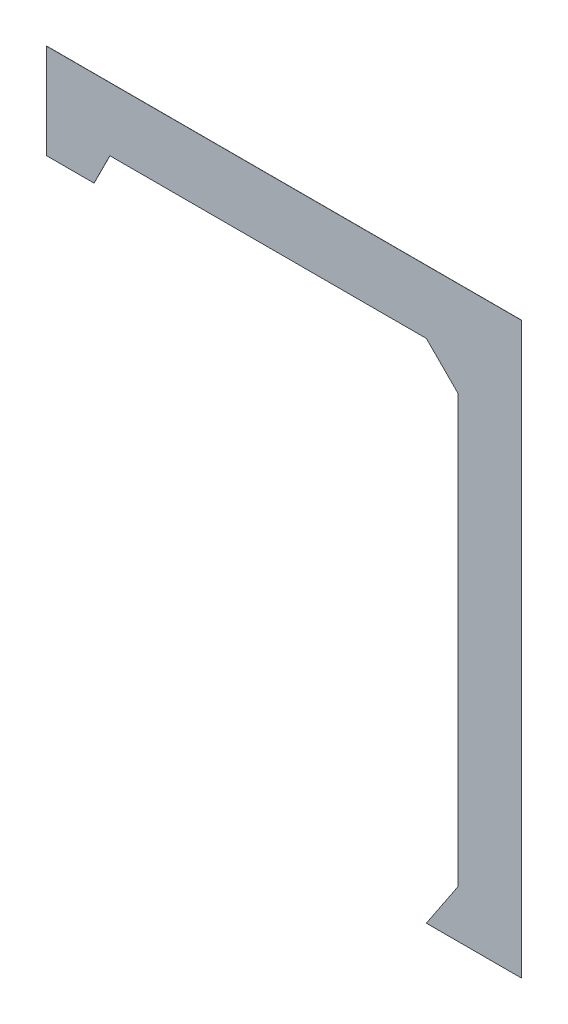
ISO-10303-21;
HEADER;
FILE_DESCRIPTION(('STEP AP214'),'2;1');
FILE_NAME('part.step','',(''),(''),'','','');
FILE_SCHEMA(('AUTOMOTIVE_DESIGN { 1 0 10303 214 1 1 1 1 }'));
ENDSEC;
DATA;
#1=APPLICATION_CONTEXT('core data for automotive mechanical design processes');
#2=APPLICATION_PROTOCOL_DEFINITION('international standard','automotive_design',2000,#1);
#3=PRODUCT_CONTEXT('',#1,'mechanical');
#4=PRODUCT('Part','Part','',(#3));
#5=PRODUCT_RELATED_PRODUCT_CATEGORY('part','',(#4));
#6=PRODUCT_DEFINITION_FORMATION('','',#4);
#7=PRODUCT_DEFINITION_CONTEXT('part definition',#1,'design');
#8=PRODUCT_DEFINITION('design','',#6,#7);
#9=PRODUCT_DEFINITION_SHAPE('','',#8);
#10=(LENGTH_UNIT() NAMED_UNIT(*) SI_UNIT(.MILLI.,.METRE.));
#11=(NAMED_UNIT(*) PLANE_ANGLE_UNIT() SI_UNIT($,.RADIAN.));
#12=(NAMED_UNIT(*) SI_UNIT($,.STERADIAN.) SOLID_ANGLE_UNIT());
#13=UNCERTAINTY_MEASURE_WITH_UNIT(LENGTH_MEASURE(1.E-05),#10,'distance_accuracy_value','');
#14=(GEOMETRIC_REPRESENTATION_CONTEXT(3) GLOBAL_UNCERTAINTY_ASSIGNED_CONTEXT((#13)) GLOBAL_UNIT_ASSIGNED_CONTEXT((#10,
#11,#12)) REPRESENTATION_CONTEXT('',''));
#15=CARTESIAN_POINT('',(0.,0.,0.));
#16=DIRECTION('',(0.,0.,1.));
#17=DIRECTION('',(1.,0.,0.));
#18=AXIS2_PLACEMENT_3D('',#15,#16,#17);
#19=CARTESIAN_POINT('',(0.2794,-0.381,0.000254));
#20=DIRECTION('',(0.,0.,-1.));
#21=DIRECTION('',(0.,-1.,0.));
#22=AXIS2_PLACEMENT_3D('',#19,#20,#21);
#23=PLANE('',#22);
#24=DIRECTION('',(-0.554700196224998,-0.832050294337998,0.));
#25=VECTOR('',#24,1.);
#26=CARTESIAN_POINT('',(0.2794,-0.381,0.000254));
#27=LINE('',#26,#25);
#28=CARTESIAN_POINT('',(0.2794,-0.381,0.000254));
#29=VERTEX_POINT('',#28);
#30=CARTESIAN_POINT('',(0.2286,-0.4572,0.000254));
#31=VERTEX_POINT('',#30);
#32=EDGE_CURVE('E183',#29,#31,#27,.T.);
#33=ORIENTED_EDGE('',*,*,#32,.T.);
#34=DIRECTION('',(1.,0.,0.));
#35=VECTOR('',#34,1.);
#36=CARTESIAN_POINT('',(0.2286,-0.4572,0.000254));
#37=LINE('',#36,#35);
#38=CARTESIAN_POINT('',(0.381,-0.4572,0.000254));
#39=VERTEX_POINT('',#38);
#40=EDGE_CURVE('E200',#31,#39,#37,.T.);
#41=ORIENTED_EDGE('',*,*,#40,.T.);
#42=DIRECTION('',(0.,1.,0.));
#43=VECTOR('',#42,1.);
#44=CARTESIAN_POINT('',(0.381,-0.4572,0.000254));
#45=LINE('',#44,#43);
#46=CARTESIAN_POINT('',(0.381,0.4572,0.000254));
#47=VERTEX_POINT('',#46);
#48=EDGE_CURVE('E195',#39,#47,#45,.T.);
#49=ORIENTED_EDGE('',*,*,#48,.T.);
#50=DIRECTION('',(-1.,0.,0.));
#51=VECTOR('',#50,1.);
#52=CARTESIAN_POINT('',(0.381,0.4572,0.000254));
#53=LINE('',#52,#51);
#54=CARTESIAN_POINT('',(-0.381,0.4572,0.000254));
#55=VERTEX_POINT('',#54);
#56=EDGE_CURVE('E107',#47,#55,#53,.T.);
#57=ORIENTED_EDGE('',*,*,#56,.T.);
#58=DIRECTION('',(0.,-1.,0.));
#59=VECTOR('',#58,1.);
#60=CARTESIAN_POINT('',(-0.381,0.4572,0.000254));
#61=LINE('',#60,#59);
#62=CARTESIAN_POINT('',(-0.381,0.3048,0.000254));
#63=VERTEX_POINT('',#62);
#64=EDGE_CURVE('E120',#55,#63,#61,.T.);
#65=ORIENTED_EDGE('',*,*,#64,.T.);
#66=DIRECTION('',(1.,0.,0.));
#67=VECTOR('',#66,1.);
#68=CARTESIAN_POINT('',(-0.381,0.3048,0.000254));
#69=LINE('',#68,#67);
#70=CARTESIAN_POINT('',(-0.3048,0.3048,0.000254));
#71=VERTEX_POINT('',#70);
#72=EDGE_CURVE('E187',#63,#71,#69,.T.);
#73=ORIENTED_EDGE('',*,*,#72,.T.);
#74=DIRECTION('',(0.447213595500758,0.894427190999516,0.));
#75=VECTOR('',#74,1.);
#76=CARTESIAN_POINT('',(-0.3048,0.3048,0.000254));
#77=LINE('',#76,#75);
#78=CARTESIAN_POINT('',(-0.2794,0.3556,0.000254));
#79=VERTEX_POINT('',#78);
#80=EDGE_CURVE('E165',#71,#79,#77,.T.);
#81=ORIENTED_EDGE('',*,*,#80,.T.);
#82=DIRECTION('',(1.,0.,0.));
#83=VECTOR('',#82,1.);
#84=CARTESIAN_POINT('',(-0.2794,0.3556,0.000254));
#85=LINE('',#84,#83);
#86=CARTESIAN_POINT('',(0.2286,0.3556,0.000254));
#87=VERTEX_POINT('',#86);
#88=EDGE_CURVE('E139',#79,#87,#85,.T.);
#89=ORIENTED_EDGE('',*,*,#88,.T.);
#90=DIRECTION('',(0.707106781186048,-0.707106781187048,0.));
#91=VECTOR('',#90,1.);
#92=CARTESIAN_POINT('',(0.2286,0.3556,0.000254));
#93=LINE('',#92,#91);
#94=CARTESIAN_POINT('',(0.2794,0.3048,0.000254));
#95=VERTEX_POINT('',#94);
#96=EDGE_CURVE('E157',#87,#95,#93,.T.);
#97=ORIENTED_EDGE('',*,*,#96,.T.);
#98=DIRECTION('',(0.,-1.,0.));
#99=VECTOR('',#98,1.);
#100=CARTESIAN_POINT('',(0.2794,0.3048,0.000254));
#101=LINE('',#100,#99);
#102=EDGE_CURVE('E11',#95,#29,#101,.T.);
#103=ORIENTED_EDGE('',*,*,#102,.T.);
#104=EDGE_LOOP('',(#33,#41,#49,#57,#65,#73,#81,#89,#97,#103));
#105=FACE_BOUND('',#104,.T.);
#106=ADVANCED_FACE('F17',(#105),#23,.F.);
#107=CARTESIAN_POINT('',(0.2794,-0.381,0.));
#108=DIRECTION('',(0.,0.,-1.));
#109=DIRECTION('',(0.,-1.,0.));
#110=AXIS2_PLACEMENT_3D('',#107,#108,#109);
#111=PLANE('',#110);
#112=DIRECTION('',(-0.554700196224998,-0.832050294337998,0.));
#113=VECTOR('',#112,1.);
#114=CARTESIAN_POINT('',(0.2794,-0.381,0.));
#115=LINE('',#114,#113);
#116=CARTESIAN_POINT('',(0.2794,-0.381,0.));
#117=VERTEX_POINT('',#116);
#118=CARTESIAN_POINT('',(0.2286,-0.4572,0.));
#119=VERTEX_POINT('',#118);
#120=EDGE_CURVE('E191',#117,#119,#115,.T.);
#121=ORIENTED_EDGE('',*,*,#120,.F.);
#122=DIRECTION('',(0.,-1.,0.));
#123=VECTOR('',#122,1.);
#124=CARTESIAN_POINT('',(0.2794,0.3048,0.));
#125=LINE('',#124,#123);
#126=CARTESIAN_POINT('',(0.2794,0.3048,0.));
#127=VERTEX_POINT('',#126);
#128=EDGE_CURVE('E28',#127,#117,#125,.T.);
#129=ORIENTED_EDGE('',*,*,#128,.F.);
#130=DIRECTION('',(0.707106781186048,-0.707106781187048,0.));
#131=VECTOR('',#130,1.);
#132=CARTESIAN_POINT('',(0.2286,0.3556,0.));
#133=LINE('',#132,#131);
#134=CARTESIAN_POINT('',(0.2286,0.3556,0.));
#135=VERTEX_POINT('',#134);
#136=EDGE_CURVE('E145',#135,#127,#133,.T.);
#137=ORIENTED_EDGE('',*,*,#136,.F.);
#138=DIRECTION('',(1.,0.,0.));
#139=VECTOR('',#138,1.);
#140=CARTESIAN_POINT('',(-0.2794,0.3556,0.));
#141=LINE('',#140,#139);
#142=CARTESIAN_POINT('',(-0.2794,0.3556,0.));
#143=VERTEX_POINT('',#142);
#144=EDGE_CURVE('E149',#143,#135,#141,.T.);
#145=ORIENTED_EDGE('',*,*,#144,.F.);
#146=DIRECTION('',(0.447213595500758,0.894427190999516,0.));
#147=VECTOR('',#146,1.);
#148=CARTESIAN_POINT('',(-0.3048,0.3048,0.));
#149=LINE('',#148,#147);
#150=CARTESIAN_POINT('',(-0.3048,0.3048,0.));
#151=VERTEX_POINT('',#150);
#152=EDGE_CURVE('E184',#151,#143,#149,.T.);
#153=ORIENTED_EDGE('',*,*,#152,.F.);
#154=DIRECTION('',(1.,0.,0.));
#155=VECTOR('',#154,1.);
#156=CARTESIAN_POINT('',(-0.381,0.3048,0.));
#157=LINE('',#156,#155);
#158=CARTESIAN_POINT('',(-0.381,0.3048,0.));
#159=VERTEX_POINT('',#158);
#160=EDGE_CURVE('E224',#159,#151,#157,.T.);
#161=ORIENTED_EDGE('',*,*,#160,.F.);
#162=DIRECTION('',(0.,-1.,0.));
#163=VECTOR('',#162,1.);
#164=CARTESIAN_POINT('',(-0.381,0.4572,0.));
#165=LINE('',#164,#163);
#166=CARTESIAN_POINT('',(-0.381,0.4572,0.));
#167=VERTEX_POINT('',#166);
#168=EDGE_CURVE('E21',#167,#159,#165,.T.);
#169=ORIENTED_EDGE('',*,*,#168,.F.);
#170=DIRECTION('',(-1.,0.,0.));
#171=VECTOR('',#170,1.);
#172=CARTESIAN_POINT('',(0.381,0.4572,0.));
#173=LINE('',#172,#171);
#174=CARTESIAN_POINT('',(0.381,0.4572,0.));
#175=VERTEX_POINT('',#174);
#176=EDGE_CURVE('E198',#175,#167,#173,.T.);
#177=ORIENTED_EDGE('',*,*,#176,.F.);
#178=DIRECTION('',(0.,1.,0.));
#179=VECTOR('',#178,1.);
#180=CARTESIAN_POINT('',(0.381,-0.4572,0.));
#181=LINE('',#180,#179);
#182=CARTESIAN_POINT('',(0.381,-0.4572,0.));
#183=VERTEX_POINT('',#182);
#184=EDGE_CURVE('E204',#183,#175,#181,.T.);
#185=ORIENTED_EDGE('',*,*,#184,.F.);
#186=DIRECTION('',(1.,0.,0.));
#187=VECTOR('',#186,1.);
#188=CARTESIAN_POINT('',(0.2286,-0.4572,0.));
#189=LINE('',#188,#187);
#190=EDGE_CURVE('E59',#119,#183,#189,.T.);
#191=ORIENTED_EDGE('',*,*,#190,.F.);
#192=EDGE_LOOP('',(#121,#129,#137,#145,#153,#161,#169,#177,#185,#191));
#193=FACE_BOUND('',#192,.T.);
#194=ADVANCED_FACE('F147',(#193),#111,.T.);
#195=CARTESIAN_POINT('',(0.2794,0.3048,0.));
#196=DIRECTION('',(1.,0.,0.));
#197=DIRECTION('',(0.,1.,0.));
#198=AXIS2_PLACEMENT_3D('',#195,#196,#197);
#199=PLANE('',#198);
#200=DIRECTION('',(0.,0.,1.));
#201=VECTOR('',#200,1.);
#202=CARTESIAN_POINT('',(0.2794,0.3048,0.));
#203=LINE('',#202,#201);
#204=EDGE_CURVE('E153',#127,#95,#203,.T.);
#205=ORIENTED_EDGE('',*,*,#204,.F.);
#206=ORIENTED_EDGE('',*,*,#128,.T.);
#207=DIRECTION('',(0.,0.,1.));
#208=VECTOR('',#207,1.);
#209=CARTESIAN_POINT('',(0.2794,-0.381,0.));
#210=LINE('',#209,#208);
#211=EDGE_CURVE('E212',#117,#29,#210,.T.);
#212=ORIENTED_EDGE('',*,*,#211,.T.);
#213=ORIENTED_EDGE('',*,*,#102,.F.);
#214=EDGE_LOOP('',(#205,#206,#212,#213));
#215=FACE_BOUND('',#214,.T.);
#216=ADVANCED_FACE('F423',(#215),#199,.F.);
#217=CARTESIAN_POINT('',(0.2286,0.3556,0.));
#218=DIRECTION('',(0.707106781187048,0.707106781186048,0.));
#219=DIRECTION('',(0.,0.,-1.));
#220=AXIS2_PLACEMENT_3D('',#217,#218,#219);
#221=PLANE('',#220);
#222=DIRECTION('',(0.,0.,1.));
#223=VECTOR('',#222,1.);
#224=CARTESIAN_POINT('',(0.2286,0.3556,0.));
#225=LINE('',#224,#223);
#226=EDGE_CURVE('E155',#135,#87,#225,.T.);
#227=ORIENTED_EDGE('',*,*,#226,.F.);
#228=ORIENTED_EDGE('',*,*,#136,.T.);
#229=ORIENTED_EDGE('',*,*,#204,.T.);
#230=ORIENTED_EDGE('',*,*,#96,.F.);
#231=EDGE_LOOP('',(#227,#228,#229,#230));
#232=FACE_BOUND('',#231,.T.);
#233=ADVANCED_FACE('F156',(#232),#221,.F.);
#234=CARTESIAN_POINT('',(-0.2794,0.3556,0.));
#235=DIRECTION('',(0.,1.,0.));
#236=DIRECTION('',(1.,0.,0.));
#237=AXIS2_PLACEMENT_3D('',#234,#235,#236);
#238=PLANE('',#237);
#239=DIRECTION('',(0.,0.,1.));
#240=VECTOR('',#239,1.);
#241=CARTESIAN_POINT('',(-0.2794,0.3556,0.));
#242=LINE('',#241,#240);
#243=EDGE_CURVE('E162',#143,#79,#242,.T.);
#244=ORIENTED_EDGE('',*,*,#243,.F.);
#245=ORIENTED_EDGE('',*,*,#144,.T.);
#246=ORIENTED_EDGE('',*,*,#226,.T.);
#247=ORIENTED_EDGE('',*,*,#88,.F.);
#248=EDGE_LOOP('',(#244,#245,#246,#247));
#249=FACE_BOUND('',#248,.T.);
#250=ADVANCED_FACE('F160',(#249),#238,.F.);
#251=CARTESIAN_POINT('',(-0.3048,0.3048,0.));
#252=DIRECTION('',(-0.894427190999516,0.447213595500758,0.));
#253=DIRECTION('',(0.,0.,1.));
#254=AXIS2_PLACEMENT_3D('',#251,#252,#253);
#255=PLANE('',#254);
#256=DIRECTION('',(0.,0.,1.));
#257=VECTOR('',#256,1.);
#258=CARTESIAN_POINT('',(-0.3048,0.3048,0.));
#259=LINE('',#258,#257);
#260=EDGE_CURVE('E220',#151,#71,#259,.T.);
#261=ORIENTED_EDGE('',*,*,#260,.F.);
#262=ORIENTED_EDGE('',*,*,#152,.T.);
#263=ORIENTED_EDGE('',*,*,#243,.T.);
#264=ORIENTED_EDGE('',*,*,#80,.F.);
#265=EDGE_LOOP('',(#261,#262,#263,#264));
#266=FACE_BOUND('',#265,.T.);
#267=ADVANCED_FACE('F247',(#266),#255,.F.);
#268=CARTESIAN_POINT('',(-0.381,0.3048,0.));
#269=DIRECTION('',(0.,1.,0.));
#270=DIRECTION('',(1.,0.,0.));
#271=AXIS2_PLACEMENT_3D('',#268,#269,#270);
#272=PLANE('',#271);
#273=DIRECTION('',(0.,0.,1.));
#274=VECTOR('',#273,1.);
#275=CARTESIAN_POINT('',(-0.381,0.3048,0.));
#276=LINE('',#275,#274);
#277=EDGE_CURVE('E227',#159,#63,#276,.T.);
#278=ORIENTED_EDGE('',*,*,#277,.F.);
#279=ORIENTED_EDGE('',*,*,#160,.T.);
#280=ORIENTED_EDGE('',*,*,#260,.T.);
#281=ORIENTED_EDGE('',*,*,#72,.F.);
#282=EDGE_LOOP('',(#278,#279,#280,#281));
#283=FACE_BOUND('',#282,.T.);
#284=ADVANCED_FACE('F245',(#283),#272,.F.);
#285=CARTESIAN_POINT('',(-0.381,0.4572,0.));
#286=DIRECTION('',(1.,0.,0.));
#287=DIRECTION('',(0.,1.,0.));
#288=AXIS2_PLACEMENT_3D('',#285,#286,#287);
#289=PLANE('',#288);
#290=DIRECTION('',(0.,0.,1.));
#291=VECTOR('',#290,1.);
#292=CARTESIAN_POINT('',(-0.381,0.4572,0.));
#293=LINE('',#292,#291);
#294=EDGE_CURVE('E177',#167,#55,#293,.T.);
#295=ORIENTED_EDGE('',*,*,#294,.F.);
#296=ORIENTED_EDGE('',*,*,#168,.T.);
#297=ORIENTED_EDGE('',*,*,#277,.T.);
#298=ORIENTED_EDGE('',*,*,#64,.F.);
#299=EDGE_LOOP('',(#295,#296,#297,#298));
#300=FACE_BOUND('',#299,.T.);
#301=ADVANCED_FACE('F248',(#300),#289,.F.);
#302=CARTESIAN_POINT('',(0.381,0.4572,0.));
#303=DIRECTION('',(0.,-1.,0.));
#304=DIRECTION('',(0.,0.,-1.));
#305=AXIS2_PLACEMENT_3D('',#302,#303,#304);
#306=PLANE('',#305);
#307=DIRECTION('',(0.,0.,1.));
#308=VECTOR('',#307,1.);
#309=CARTESIAN_POINT('',(0.381,0.4572,0.));
#310=LINE('',#309,#308);
#311=EDGE_CURVE('E199',#175,#47,#310,.T.);
#312=ORIENTED_EDGE('',*,*,#311,.F.);
#313=ORIENTED_EDGE('',*,*,#176,.T.);
#314=ORIENTED_EDGE('',*,*,#294,.T.);
#315=ORIENTED_EDGE('',*,*,#56,.F.);
#316=EDGE_LOOP('',(#312,#313,#314,#315));
#317=FACE_BOUND('',#316,.T.);
#318=ADVANCED_FACE('F19',(#317),#306,.F.);
#319=CARTESIAN_POINT('',(0.381,-0.4572,0.));
#320=DIRECTION('',(-1.,0.,0.));
#321=DIRECTION('',(0.,0.,1.));
#322=AXIS2_PLACEMENT_3D('',#319,#320,#321);
#323=PLANE('',#322);
#324=DIRECTION('',(0.,0.,1.));
#325=VECTOR('',#324,1.);
#326=CARTESIAN_POINT('',(0.381,-0.4572,0.));
#327=LINE('',#326,#325);
#328=EDGE_CURVE('E182',#183,#39,#327,.T.);
#329=ORIENTED_EDGE('',*,*,#328,.F.);
#330=ORIENTED_EDGE('',*,*,#184,.T.);
#331=ORIENTED_EDGE('',*,*,#311,.T.);
#332=ORIENTED_EDGE('',*,*,#48,.F.);
#333=EDGE_LOOP('',(#329,#330,#331,#332));
#334=FACE_BOUND('',#333,.T.);
#335=ADVANCED_FACE('F365',(#334),#323,.F.);
#336=CARTESIAN_POINT('',(0.2286,-0.4572,0.));
#337=DIRECTION('',(0.,1.,0.));
#338=DIRECTION('',(1.,0.,0.));
#339=AXIS2_PLACEMENT_3D('',#336,#337,#338);
#340=PLANE('',#339);
#341=DIRECTION('',(0.,0.,1.));
#342=VECTOR('',#341,1.);
#343=CARTESIAN_POINT('',(0.2286,-0.4572,0.));
#344=LINE('',#343,#342);
#345=EDGE_CURVE('E188',#119,#31,#344,.T.);
#346=ORIENTED_EDGE('',*,*,#345,.F.);
#347=ORIENTED_EDGE('',*,*,#190,.T.);
#348=ORIENTED_EDGE('',*,*,#328,.T.);
#349=ORIENTED_EDGE('',*,*,#40,.F.);
#350=EDGE_LOOP('',(#346,#347,#348,#349));
#351=FACE_BOUND('',#350,.T.);
#352=ADVANCED_FACE('F352',(#351),#340,.F.);
#353=CARTESIAN_POINT('',(0.2794,-0.381,0.));
#354=DIRECTION('',(0.832050294337998,-0.554700196224998,0.));
#355=DIRECTION('',(0.,0.,-1.));
#356=AXIS2_PLACEMENT_3D('',#353,#354,#355);
#357=PLANE('',#356);
#358=ORIENTED_EDGE('',*,*,#211,.F.);
#359=ORIENTED_EDGE('',*,*,#120,.T.);
#360=ORIENTED_EDGE('',*,*,#345,.T.);
#361=ORIENTED_EDGE('',*,*,#32,.F.);
#362=EDGE_LOOP('',(#358,#359,#360,#361));
#363=FACE_BOUND('',#362,.T.);
#364=ADVANCED_FACE('F346',(#363),#357,.F.);
#365=CLOSED_SHELL('',(#106,#194,#216,#233,#250,#267,#284,#301,#318,#335,#352,#364));
#366=MANIFOLD_SOLID_BREP('B1',#365);
#367=ADVANCED_BREP_SHAPE_REPRESENTATION('',(#18,#366),#14);
#368=SHAPE_DEFINITION_REPRESENTATION(#9,#367);
ENDSEC;
END-ISO-10303-21;
